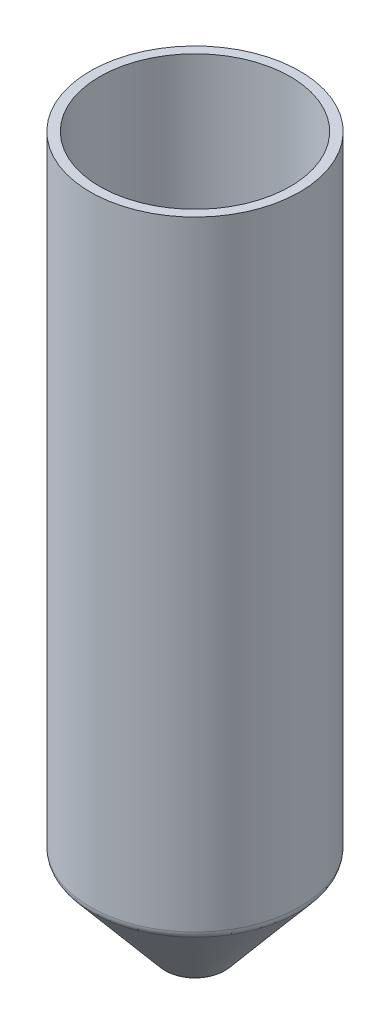
ISO-10303-21;
HEADER;
FILE_DESCRIPTION(('STEP AP214'),'2;1');
FILE_NAME('part.step','',(''),(''),'','','');
FILE_SCHEMA(('AUTOMOTIVE_DESIGN { 1 0 10303 214 1 1 1 1 }'));
ENDSEC;
DATA;
#1=APPLICATION_CONTEXT('core data for automotive mechanical design processes');
#2=APPLICATION_PROTOCOL_DEFINITION('international standard','automotive_design',2000,#1);
#3=PRODUCT_CONTEXT('',#1,'mechanical');
#4=PRODUCT('Part','Part','',(#3));
#5=PRODUCT_RELATED_PRODUCT_CATEGORY('part','',(#4));
#6=PRODUCT_DEFINITION_FORMATION('','',#4);
#7=PRODUCT_DEFINITION_CONTEXT('part definition',#1,'design');
#8=PRODUCT_DEFINITION('design','',#6,#7);
#9=PRODUCT_DEFINITION_SHAPE('','',#8);
#10=(LENGTH_UNIT() NAMED_UNIT(*) SI_UNIT(.MILLI.,.METRE.));
#11=(NAMED_UNIT(*) PLANE_ANGLE_UNIT() SI_UNIT($,.RADIAN.));
#12=(NAMED_UNIT(*) SI_UNIT($,.STERADIAN.) SOLID_ANGLE_UNIT());
#13=UNCERTAINTY_MEASURE_WITH_UNIT(LENGTH_MEASURE(1.E-05),#10,'distance_accuracy_value','');
#14=(GEOMETRIC_REPRESENTATION_CONTEXT(3) GLOBAL_UNCERTAINTY_ASSIGNED_CONTEXT((#13)) GLOBAL_UNIT_ASSIGNED_CONTEXT((#10,
#11,#12)) REPRESENTATION_CONTEXT('',''));
#15=CARTESIAN_POINT('',(0.,0.,0.));
#16=DIRECTION('',(0.,0.,1.));
#17=DIRECTION('',(1.,0.,0.));
#18=AXIS2_PLACEMENT_3D('',#15,#16,#17);
#19=CARTESIAN_POINT('',(0.,0.,0.));
#20=DIRECTION('',(0.,1.,0.));
#21=DIRECTION('',(-1.,0.,0.));
#22=AXIS2_PLACEMENT_3D('',#19,#20,#21);
#23=CYLINDRICAL_SURFACE('',#22,20.);
#24=CARTESIAN_POINT('',(0.,-130.,0.));
#25=DIRECTION('',(0.,1.,0.));
#26=DIRECTION('',(-1.,0.,0.));
#27=AXIS2_PLACEMENT_3D('',#24,#25,#26);
#28=CIRCLE('',#27,20.);
#29=CARTESIAN_POINT('',(-20.,-130.,0.));
#30=VERTEX_POINT('',#29);
#31=EDGE_CURVE('E55',#30,#30,#28,.T.);
#32=ORIENTED_EDGE('',*,*,#31,.F.);
#33=EDGE_LOOP('',(#32));
#34=FACE_BOUND('',#33,.T.);
#35=CARTESIAN_POINT('',(0.,0.,0.));
#36=DIRECTION('',(0.,1.,0.));
#37=DIRECTION('',(-1.,0.,0.));
#38=AXIS2_PLACEMENT_3D('',#35,#36,#37);
#39=CIRCLE('',#38,20.);
#40=CARTESIAN_POINT('',(-20.,0.,0.));
#41=VERTEX_POINT('',#40);
#42=EDGE_CURVE('E64',#41,#41,#39,.T.);
#43=ORIENTED_EDGE('',*,*,#42,.T.);
#44=EDGE_LOOP('',(#43));
#45=FACE_BOUND('',#44,.T.);
#46=ADVANCED_FACE('F35',(#34,#45),#23,.F.);
#47=CARTESIAN_POINT('',(0.,-130.,0.));
#48=DIRECTION('',(0.,1.,0.));
#49=DIRECTION('',(-1.,0.,0.));
#50=AXIS2_PLACEMENT_3D('',#47,#48,#49);
#51=CONICAL_SURFACE('',#50,20.,0.698131700797733);
#52=CARTESIAN_POINT('',(0.,-150.,0.));
#53=DIRECTION('',(0.,1.,0.));
#54=DIRECTION('',(-1.,0.,0.));
#55=AXIS2_PLACEMENT_3D('',#52,#53,#54);
#56=CIRCLE('',#55,3.21800737645437);
#57=CARTESIAN_POINT('',(-3.21800737645435,-150.,0.));
#58=VERTEX_POINT('',#57);
#59=EDGE_CURVE('E58',#58,#58,#56,.T.);
#60=ORIENTED_EDGE('',*,*,#59,.F.);
#61=EDGE_LOOP('',(#60));
#62=FACE_BOUND('',#61,.T.);
#63=ORIENTED_EDGE('',*,*,#31,.T.);
#64=EDGE_LOOP('',(#63));
#65=FACE_BOUND('',#64,.T.);
#66=ADVANCED_FACE('F84',(#62,#65),#51,.F.);
#67=CARTESIAN_POINT('',(-3.21800737645435,-150.,0.));
#68=DIRECTION('',(0.,1.,0.));
#69=DIRECTION('',(-1.,0.,0.));
#70=AXIS2_PLACEMENT_3D('',#67,#68,#69);
#71=PLANE('',#70);
#72=CARTESIAN_POINT('',(0.,-150.,0.));
#73=DIRECTION('',(0.,1.,0.));
#74=DIRECTION('',(-1.,0.,0.));
#75=AXIS2_PLACEMENT_3D('',#72,#73,#74);
#76=CIRCLE('',#75,4.89620663880894);
#77=CARTESIAN_POINT('',(-4.89620663880893,-150.,0.));
#78=VERTEX_POINT('',#77);
#79=EDGE_CURVE('E10',#78,#78,#76,.F.);
#80=ORIENTED_EDGE('',*,*,#79,.T.);
#81=EDGE_LOOP('',(#80));
#82=FACE_BOUND('',#81,.T.);
#83=ORIENTED_EDGE('',*,*,#59,.T.);
#84=EDGE_LOOP('',(#83));
#85=FACE_BOUND('',#84,.T.);
#86=ADVANCED_FACE('F90',(#82,#85),#71,.F.);
#87=CARTESIAN_POINT('',(0.,-130.727940468532,0.));
#88=DIRECTION('',(0.,1.,0.));
#89=DIRECTION('',(-1.,0.,0.));
#90=AXIS2_PLACEMENT_3D('',#87,#88,#89);
#91=CONICAL_SURFACE('',#90,22.,0.698131700797734);
#92=CARTESIAN_POINT('',(0.,-149.285575219373,0.));
#93=DIRECTION('',(0.,1.,0.));
#94=DIRECTION('',(-1.,0.,0.));
#95=AXIS2_PLACEMENT_3D('',#92,#93,#94);
#96=CIRCLE('',#95,6.42829552504691);
#97=CARTESIAN_POINT('',(-6.42829552504689,-149.285575219373,0.));
#98=VERTEX_POINT('',#97);
#99=EDGE_CURVE('E42',#98,#98,#96,.T.);
#100=ORIENTED_EDGE('',*,*,#99,.T.);
#101=EDGE_LOOP('',(#100));
#102=FACE_BOUND('',#101,.T.);
#103=CARTESIAN_POINT('',(0.,-131.285575219373,0.));
#104=DIRECTION('',(0.,-1.,0.));
#105=DIRECTION('',(1.,0.,0.));
#106=AXIS2_PLACEMENT_3D('',#103,#104,#105);
#107=CIRCLE('',#106,21.532088886238);
#108=CARTESIAN_POINT('',(21.532088886238,-131.285575219373,0.));
#109=VERTEX_POINT('',#108);
#110=EDGE_CURVE('E46',#109,#109,#107,.T.);
#111=ORIENTED_EDGE('',*,*,#110,.T.);
#112=EDGE_LOOP('',(#111));
#113=FACE_BOUND('',#112,.T.);
#114=ADVANCED_FACE('F80',(#102,#113),#91,.T.);
#115=CARTESIAN_POINT('',(0.,0.,0.));
#116=DIRECTION('',(0.,1.,0.));
#117=DIRECTION('',(-1.,0.,0.));
#118=AXIS2_PLACEMENT_3D('',#115,#116,#117);
#119=CYLINDRICAL_SURFACE('',#118,22.);
#120=CARTESIAN_POINT('',(0.,-130.,0.));
#121=DIRECTION('',(0.,-1.,0.));
#122=DIRECTION('',(1.,0.,0.));
#123=AXIS2_PLACEMENT_3D('',#120,#121,#122);
#124=CIRCLE('',#123,22.);
#125=CARTESIAN_POINT('',(22.,-130.,0.));
#126=VERTEX_POINT('',#125);
#127=EDGE_CURVE('E50',#126,#126,#124,.F.);
#128=ORIENTED_EDGE('',*,*,#127,.T.);
#129=EDGE_LOOP('',(#128));
#130=FACE_BOUND('',#129,.T.);
#131=CARTESIAN_POINT('',(0.,0.,0.));
#132=DIRECTION('',(0.,1.,0.));
#133=DIRECTION('',(-1.,0.,0.));
#134=AXIS2_PLACEMENT_3D('',#131,#132,#133);
#135=CIRCLE('',#134,22.);
#136=CARTESIAN_POINT('',(-22.,0.,0.));
#137=VERTEX_POINT('',#136);
#138=EDGE_CURVE('E61',#137,#137,#135,.T.);
#139=ORIENTED_EDGE('',*,*,#138,.F.);
#140=EDGE_LOOP('',(#139));
#141=FACE_BOUND('',#140,.T.);
#142=ADVANCED_FACE('F72',(#130,#141),#119,.T.);
#143=CARTESIAN_POINT('',(-20.,0.,0.));
#144=DIRECTION('',(0.,1.,0.));
#145=DIRECTION('',(-1.,0.,0.));
#146=AXIS2_PLACEMENT_3D('',#143,#144,#145);
#147=PLANE('',#146);
#148=ORIENTED_EDGE('',*,*,#138,.T.);
#149=EDGE_LOOP('',(#148));
#150=FACE_BOUND('',#149,.T.);
#151=ORIENTED_EDGE('',*,*,#42,.F.);
#152=EDGE_LOOP('',(#151));
#153=FACE_BOUND('',#152,.T.);
#154=ADVANCED_FACE('F69',(#150,#153),#147,.T.);
#155=CARTESIAN_POINT('',(0.,-130.,0.));
#156=DIRECTION('',(0.,-1.,0.));
#157=DIRECTION('',(1.,0.,0.));
#158=AXIS2_PLACEMENT_3D('',#155,#156,#157);
#159=TOROIDAL_SURFACE('',#158,20.,2.);
#160=ORIENTED_EDGE('',*,*,#110,.F.);
#161=EDGE_LOOP('',(#160));
#162=FACE_BOUND('',#161,.T.);
#163=ORIENTED_EDGE('',*,*,#127,.F.);
#164=EDGE_LOOP('',(#163));
#165=FACE_BOUND('',#164,.T.);
#166=ADVANCED_FACE('F71',(#162,#165),#159,.T.);
#167=CARTESIAN_POINT('',(0.,-148.,0.));
#168=DIRECTION('',(0.,1.,0.));
#169=DIRECTION('',(-1.,0.,0.));
#170=AXIS2_PLACEMENT_3D('',#167,#168,#169);
#171=TOROIDAL_SURFACE('',#170,4.89620663880894,2.);
#172=ORIENTED_EDGE('',*,*,#79,.F.);
#173=EDGE_LOOP('',(#172));
#174=FACE_BOUND('',#173,.T.);
#175=ORIENTED_EDGE('',*,*,#99,.F.);
#176=EDGE_LOOP('',(#175));
#177=FACE_BOUND('',#176,.T.);
#178=ADVANCED_FACE('F37',(#174,#177),#171,.T.);
#179=CLOSED_SHELL('',(#46,#66,#86,#114,#142,#154,#166,#178));
#180=MANIFOLD_SOLID_BREP('B2',#179);
#181=ADVANCED_BREP_SHAPE_REPRESENTATION('',(#18,#180),#14);
#182=SHAPE_DEFINITION_REPRESENTATION(#9,#181);
ENDSEC;
END-ISO-10303-21;
